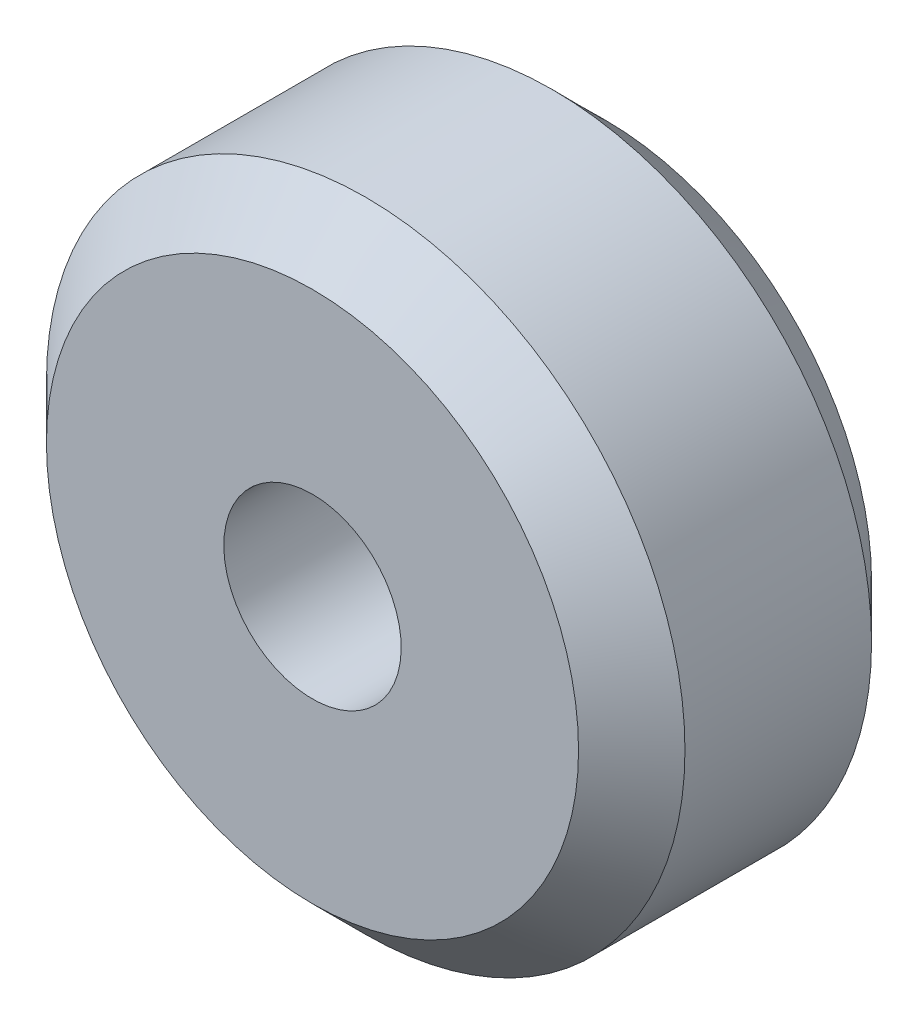
ISO-10303-21;
HEADER;
FILE_DESCRIPTION(('STEP AP214'),'2;1');
FILE_NAME('part.step','',(''),(''),'','','');
FILE_SCHEMA(('AUTOMOTIVE_DESIGN { 1 0 10303 214 1 1 1 1 }'));
ENDSEC;
DATA;
#1=APPLICATION_CONTEXT('core data for automotive mechanical design processes');
#2=APPLICATION_PROTOCOL_DEFINITION('international standard','automotive_design',2000,#1);
#3=PRODUCT_CONTEXT('',#1,'mechanical');
#4=PRODUCT('Part','Part','',(#3));
#5=PRODUCT_RELATED_PRODUCT_CATEGORY('part','',(#4));
#6=PRODUCT_DEFINITION_FORMATION('','',#4);
#7=PRODUCT_DEFINITION_CONTEXT('part definition',#1,'design');
#8=PRODUCT_DEFINITION('design','',#6,#7);
#9=PRODUCT_DEFINITION_SHAPE('','',#8);
#10=(LENGTH_UNIT() NAMED_UNIT(*) SI_UNIT(.MILLI.,.METRE.));
#11=(NAMED_UNIT(*) PLANE_ANGLE_UNIT() SI_UNIT($,.RADIAN.));
#12=(NAMED_UNIT(*) SI_UNIT($,.STERADIAN.) SOLID_ANGLE_UNIT());
#13=UNCERTAINTY_MEASURE_WITH_UNIT(LENGTH_MEASURE(1.E-05),#10,'distance_accuracy_value','');
#14=(GEOMETRIC_REPRESENTATION_CONTEXT(3) GLOBAL_UNCERTAINTY_ASSIGNED_CONTEXT((#13)) GLOBAL_UNIT_ASSIGNED_CONTEXT((#10,
#11,#12)) REPRESENTATION_CONTEXT('',''));
#15=CARTESIAN_POINT('',(0.,0.,0.));
#16=DIRECTION('',(0.,0.,1.));
#17=DIRECTION('',(1.,0.,0.));
#18=AXIS2_PLACEMENT_3D('',#15,#16,#17);
#19=CARTESIAN_POINT('',(0.,8.99999999999998,1.50000000000002));
#20=DIRECTION('',(0.,0.,-1.));
#21=DIRECTION('',(0.,1.,0.));
#22=AXIS2_PLACEMENT_3D('',#19,#20,#21);
#23=CONICAL_SURFACE('',#22,7.5,0.785398163397445);
#24=CARTESIAN_POINT('',(0.,8.99999999999999,0.));
#25=DIRECTION('',(0.,0.,1.));
#26=DIRECTION('',(0.,-1.,0.));
#27=AXIS2_PLACEMENT_3D('',#24,#25,#26);
#28=CIRCLE('',#27,8.99999999999999);
#29=CARTESIAN_POINT('',(0.,0.,0.));
#30=VERTEX_POINT('',#29);
#31=EDGE_CURVE('E54',#30,#30,#28,.T.);
#32=ORIENTED_EDGE('',*,*,#31,.T.);
#33=EDGE_LOOP('',(#32));
#34=FACE_BOUND('',#33,.T.);
#35=CARTESIAN_POINT('',(0.,8.99999999999998,1.50000000000002));
#36=DIRECTION('',(0.,0.,1.));
#37=DIRECTION('',(0.,-1.,0.));
#38=AXIS2_PLACEMENT_3D('',#35,#36,#37);
#39=CIRCLE('',#38,7.5);
#40=CARTESIAN_POINT('',(0.,1.49999999999998,1.5));
#41=VERTEX_POINT('',#40);
#42=EDGE_CURVE('E10',#41,#41,#39,.T.);
#43=ORIENTED_EDGE('',*,*,#42,.F.);
#44=EDGE_LOOP('',(#43));
#45=FACE_BOUND('',#44,.T.);
#46=ADVANCED_FACE('F37',(#34,#45),#23,.T.);
#47=CARTESIAN_POINT('',(0.,1.49999999999998,1.49999999999999));
#48=DIRECTION('',(0.,0.,1.));
#49=DIRECTION('',(0.,-1.,0.));
#50=AXIS2_PLACEMENT_3D('',#47,#48,#49);
#51=PLANE('',#50);
#52=CARTESIAN_POINT('',(0.,8.99999999999998,1.50000000000002));
#53=DIRECTION('',(0.,0.,-1.));
#54=DIRECTION('',(0.,1.,0.));
#55=AXIS2_PLACEMENT_3D('',#52,#53,#54);
#56=CIRCLE('',#55,2.5);
#57=CARTESIAN_POINT('',(0.,11.5,1.50000000000002));
#58=VERTEX_POINT('',#57);
#59=EDGE_CURVE('E60',#58,#58,#56,.T.);
#60=ORIENTED_EDGE('',*,*,#59,.T.);
#61=EDGE_LOOP('',(#60));
#62=FACE_BOUND('',#61,.T.);
#63=ORIENTED_EDGE('',*,*,#42,.T.);
#64=EDGE_LOOP('',(#63));
#65=FACE_BOUND('',#64,.T.);
#66=ADVANCED_FACE('F69',(#62,#65),#51,.T.);
#67=CARTESIAN_POINT('',(0.,1.5,-6.75999999999999));
#68=DIRECTION('',(0.,0.,-1.));
#69=DIRECTION('',(0.,1.,0.));
#70=AXIS2_PLACEMENT_3D('',#67,#68,#69);
#71=PLANE('',#70);
#72=CARTESIAN_POINT('',(0.,9.,-6.75999999999997));
#73=DIRECTION('',(0.,0.,-1.));
#74=DIRECTION('',(0.,1.,0.));
#75=AXIS2_PLACEMENT_3D('',#72,#73,#74);
#76=CIRCLE('',#75,2.5);
#77=CARTESIAN_POINT('',(0.,11.5,-6.75999999999997));
#78=VERTEX_POINT('',#77);
#79=EDGE_CURVE('E61',#78,#78,#76,.T.);
#80=ORIENTED_EDGE('',*,*,#79,.F.);
#81=EDGE_LOOP('',(#80));
#82=FACE_BOUND('',#81,.T.);
#83=CARTESIAN_POINT('',(0.,9.,-6.75999999999997));
#84=DIRECTION('',(0.,0.,1.));
#85=DIRECTION('',(0.,-1.,0.));
#86=AXIS2_PLACEMENT_3D('',#83,#84,#85);
#87=CIRCLE('',#86,7.5);
#88=CARTESIAN_POINT('',(0.,1.5,-6.75999999999998));
#89=VERTEX_POINT('',#88);
#90=EDGE_CURVE('E44',#89,#89,#87,.T.);
#91=ORIENTED_EDGE('',*,*,#90,.F.);
#92=EDGE_LOOP('',(#91));
#93=FACE_BOUND('',#92,.T.);
#94=ADVANCED_FACE('F78',(#82,#93),#71,.T.);
#95=CARTESIAN_POINT('',(0.,9.,-5.25999999999998));
#96=DIRECTION('',(0.,0.,1.));
#97=DIRECTION('',(0.,-1.,0.));
#98=AXIS2_PLACEMENT_3D('',#95,#96,#97);
#99=CONICAL_SURFACE('',#98,9.,0.785398163397453);
#100=ORIENTED_EDGE('',*,*,#90,.T.);
#101=EDGE_LOOP('',(#100));
#102=FACE_BOUND('',#101,.T.);
#103=CARTESIAN_POINT('',(0.,9.,-5.25999999999998));
#104=DIRECTION('',(0.,0.,1.));
#105=DIRECTION('',(0.,-1.,0.));
#106=AXIS2_PLACEMENT_3D('',#103,#104,#105);
#107=CIRCLE('',#106,9.);
#108=CARTESIAN_POINT('',(0.,0.,-5.26));
#109=VERTEX_POINT('',#108);
#110=EDGE_CURVE('E49',#109,#109,#107,.T.);
#111=ORIENTED_EDGE('',*,*,#110,.F.);
#112=EDGE_LOOP('',(#111));
#113=FACE_BOUND('',#112,.T.);
#114=ADVANCED_FACE('F81',(#102,#113),#99,.T.);
#115=CARTESIAN_POINT('',(0.,8.99999999999998,1.5));
#116=DIRECTION('',(0.,0.,1.));
#117=DIRECTION('',(0.,-1.,0.));
#118=AXIS2_PLACEMENT_3D('',#115,#116,#117);
#119=CYLINDRICAL_SURFACE('',#118,8.99999999999999);
#120=ORIENTED_EDGE('',*,*,#110,.T.);
#121=EDGE_LOOP('',(#120));
#122=FACE_BOUND('',#121,.T.);
#123=ORIENTED_EDGE('',*,*,#31,.F.);
#124=EDGE_LOOP('',(#123));
#125=FACE_BOUND('',#124,.T.);
#126=ADVANCED_FACE('F74',(#122,#125),#119,.T.);
#127=CARTESIAN_POINT('',(0.,8.99999999999998,1.50000000000002));
#128=DIRECTION('',(0.,0.,-1.));
#129=DIRECTION('',(0.,1.,0.));
#130=AXIS2_PLACEMENT_3D('',#127,#128,#129);
#131=CYLINDRICAL_SURFACE('',#130,2.5);
#132=ORIENTED_EDGE('',*,*,#59,.F.);
#133=EDGE_LOOP('',(#132));
#134=FACE_BOUND('',#133,.T.);
#135=ORIENTED_EDGE('',*,*,#79,.T.);
#136=EDGE_LOOP('',(#135));
#137=FACE_BOUND('',#136,.T.);
#138=ADVANCED_FACE('F71',(#134,#137),#131,.F.);
#139=CLOSED_SHELL('',(#46,#66,#94,#114,#126,#138));
#140=MANIFOLD_SOLID_BREP('B2',#139);
#141=ADVANCED_BREP_SHAPE_REPRESENTATION('',(#18,#140),#14);
#142=SHAPE_DEFINITION_REPRESENTATION(#9,#141);
ENDSEC;
END-ISO-10303-21;
